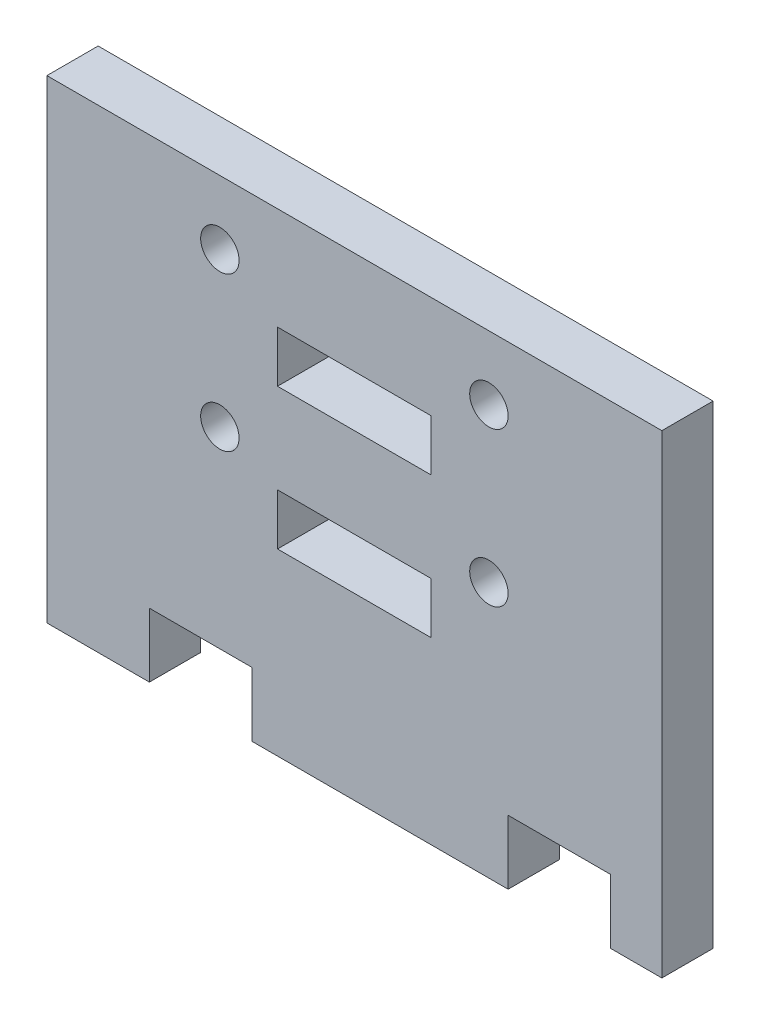
ISO-10303-21;
HEADER;
FILE_DESCRIPTION(('STEP AP214'),'2;1');
FILE_NAME('part.step','',(''),(''),'','','');
FILE_SCHEMA(('AUTOMOTIVE_DESIGN { 1 0 10303 214 1 1 1 1 }'));
ENDSEC;
DATA;
#1=APPLICATION_CONTEXT('core data for automotive mechanical design processes');
#2=APPLICATION_PROTOCOL_DEFINITION('international standard','automotive_design',2000,#1);
#3=PRODUCT_CONTEXT('',#1,'mechanical');
#4=PRODUCT('Part','Part','',(#3));
#5=PRODUCT_RELATED_PRODUCT_CATEGORY('part','',(#4));
#6=PRODUCT_DEFINITION_FORMATION('','',#4);
#7=PRODUCT_DEFINITION_CONTEXT('part definition',#1,'design');
#8=PRODUCT_DEFINITION('design','',#6,#7);
#9=PRODUCT_DEFINITION_SHAPE('','',#8);
#10=(LENGTH_UNIT() NAMED_UNIT(*) SI_UNIT(.MILLI.,.METRE.));
#11=(NAMED_UNIT(*) PLANE_ANGLE_UNIT() SI_UNIT($,.RADIAN.));
#12=(NAMED_UNIT(*) SI_UNIT($,.STERADIAN.) SOLID_ANGLE_UNIT());
#13=UNCERTAINTY_MEASURE_WITH_UNIT(LENGTH_MEASURE(1.E-05),#10,'distance_accuracy_value','');
#14=(GEOMETRIC_REPRESENTATION_CONTEXT(3) GLOBAL_UNCERTAINTY_ASSIGNED_CONTEXT((#13)) GLOBAL_UNIT_ASSIGNED_CONTEXT((#10,
#11,#12)) REPRESENTATION_CONTEXT('',''));
#15=CARTESIAN_POINT('',(0.,0.,0.));
#16=DIRECTION('',(0.,0.,1.));
#17=DIRECTION('',(1.,0.,0.));
#18=AXIS2_PLACEMENT_3D('',#15,#16,#17);
#19=CARTESIAN_POINT('',(0.,0.,2.));
#20=DIRECTION('',(0.,0.,-1.));
#21=DIRECTION('',(-1.,0.,0.));
#22=AXIS2_PLACEMENT_3D('',#19,#20,#21);
#23=PLANE('',#22);
#24=CARTESIAN_POINT('',(17.25,16.,2.));
#25=DIRECTION('',(0.,0.,1.));
#26=DIRECTION('',(-1.,0.,0.));
#27=AXIS2_PLACEMENT_3D('',#24,#25,#26);
#28=CIRCLE('',#27,0.750000000000005);
#29=CARTESIAN_POINT('',(16.5,16.,2.));
#30=VERTEX_POINT('',#29);
#31=EDGE_CURVE('E627',#30,#30,#28,.T.);
#32=ORIENTED_EDGE('',*,*,#31,.F.);
#33=EDGE_LOOP('',(#32));
#34=FACE_BOUND('',#33,.T.);
#35=DIRECTION('',(0.,-1.,0.));
#36=VECTOR('',#35,1.);
#37=CARTESIAN_POINT('',(9.00000000000001,9.,2.));
#38=LINE('',#37,#36);
#39=CARTESIAN_POINT('',(9.00000000000001,9.,2.));
#40=VERTEX_POINT('',#39);
#41=CARTESIAN_POINT('',(9.00000000000001,7.,2.));
#42=VERTEX_POINT('',#41);
#43=EDGE_CURVE('E170',#40,#42,#38,.T.);
#44=ORIENTED_EDGE('',*,*,#43,.F.);
#45=DIRECTION('',(-1.,0.,0.));
#46=VECTOR('',#45,1.);
#47=CARTESIAN_POINT('',(15.,9.,2.));
#48=LINE('',#47,#46);
#49=CARTESIAN_POINT('',(15.,9.,2.));
#50=VERTEX_POINT('',#49);
#51=EDGE_CURVE('E193',#50,#40,#48,.T.);
#52=ORIENTED_EDGE('',*,*,#51,.F.);
#53=DIRECTION('',(0.,1.,0.));
#54=VECTOR('',#53,1.);
#55=CARTESIAN_POINT('',(15.,7.,2.));
#56=LINE('',#55,#54);
#57=CARTESIAN_POINT('',(15.,7.,2.));
#58=VERTEX_POINT('',#57);
#59=EDGE_CURVE('E191',#58,#50,#56,.T.);
#60=ORIENTED_EDGE('',*,*,#59,.F.);
#61=DIRECTION('',(1.,0.,0.));
#62=VECTOR('',#61,1.);
#63=CARTESIAN_POINT('',(9.00000000000001,7.,2.));
#64=LINE('',#63,#62);
#65=EDGE_CURVE('E178',#42,#58,#64,.T.);
#66=ORIENTED_EDGE('',*,*,#65,.F.);
#67=EDGE_LOOP('',(#44,#52,#60,#66));
#68=FACE_BOUND('',#67,.T.);
#69=DIRECTION('',(1.,0.,0.));
#70=VECTOR('',#69,1.);
#71=CARTESIAN_POINT('',(9.00000000000001,12.5,2.));
#72=LINE('',#71,#70);
#73=CARTESIAN_POINT('',(9.00000000000001,12.5,2.));
#74=VERTEX_POINT('',#73);
#75=CARTESIAN_POINT('',(15.,12.5,2.));
#76=VERTEX_POINT('',#75);
#77=EDGE_CURVE('E215',#74,#76,#72,.T.);
#78=ORIENTED_EDGE('',*,*,#77,.F.);
#79=DIRECTION('',(0.,-1.,0.));
#80=VECTOR('',#79,1.);
#81=CARTESIAN_POINT('',(9.00000000000001,14.5,2.));
#82=LINE('',#81,#80);
#83=CARTESIAN_POINT('',(9.00000000000001,14.5,2.));
#84=VERTEX_POINT('',#83);
#85=EDGE_CURVE('E223',#84,#74,#82,.T.);
#86=ORIENTED_EDGE('',*,*,#85,.F.);
#87=DIRECTION('',(-1.,0.,0.));
#88=VECTOR('',#87,1.);
#89=CARTESIAN_POINT('',(15.,14.5,2.));
#90=LINE('',#89,#88);
#91=CARTESIAN_POINT('',(15.,14.5,2.));
#92=VERTEX_POINT('',#91);
#93=EDGE_CURVE('E220',#92,#84,#90,.T.);
#94=ORIENTED_EDGE('',*,*,#93,.F.);
#95=DIRECTION('',(0.,1.,0.));
#96=VECTOR('',#95,1.);
#97=CARTESIAN_POINT('',(15.,12.5,2.));
#98=LINE('',#97,#96);
#99=EDGE_CURVE('E217',#76,#92,#98,.T.);
#100=ORIENTED_EDGE('',*,*,#99,.F.);
#101=EDGE_LOOP('',(#78,#86,#94,#100));
#102=FACE_BOUND('',#101,.T.);
#103=DIRECTION('',(0.,-1.,0.));
#104=VECTOR('',#103,1.);
#105=CARTESIAN_POINT('',(0.,0.,2.));
#106=LINE('',#105,#104);
#107=CARTESIAN_POINT('',(0.,18.5,2.));
#108=VERTEX_POINT('',#107);
#109=CARTESIAN_POINT('',(0.,0.,2.));
#110=VERTEX_POINT('',#109);
#111=EDGE_CURVE('E246',#108,#110,#106,.T.);
#112=ORIENTED_EDGE('',*,*,#111,.T.);
#113=DIRECTION('',(1.,0.,0.));
#114=VECTOR('',#113,1.);
#115=CARTESIAN_POINT('',(4.,0.,2.));
#116=LINE('',#115,#114);
#117=CARTESIAN_POINT('',(4.,0.,2.));
#118=VERTEX_POINT('',#117);
#119=EDGE_CURVE('E249',#110,#118,#116,.T.);
#120=ORIENTED_EDGE('',*,*,#119,.T.);
#121=DIRECTION('',(0.,1.,0.));
#122=VECTOR('',#121,1.);
#123=CARTESIAN_POINT('',(4.,2.5,2.));
#124=LINE('',#123,#122);
#125=CARTESIAN_POINT('',(4.,2.5,2.));
#126=VERTEX_POINT('',#125);
#127=EDGE_CURVE('E252',#118,#126,#124,.T.);
#128=ORIENTED_EDGE('',*,*,#127,.T.);
#129=DIRECTION('',(1.,0.,0.));
#130=VECTOR('',#129,1.);
#131=CARTESIAN_POINT('',(4.,2.5,2.));
#132=LINE('',#131,#130);
#133=CARTESIAN_POINT('',(8.,2.5,2.));
#134=VERTEX_POINT('',#133);
#135=EDGE_CURVE('E254',#126,#134,#132,.T.);
#136=ORIENTED_EDGE('',*,*,#135,.T.);
#137=DIRECTION('',(0.,-1.,0.));
#138=VECTOR('',#137,1.);
#139=CARTESIAN_POINT('',(8.,0.,2.));
#140=LINE('',#139,#138);
#141=CARTESIAN_POINT('',(8.,0.,2.));
#142=VERTEX_POINT('',#141);
#143=EDGE_CURVE('E256',#134,#142,#140,.T.);
#144=ORIENTED_EDGE('',*,*,#143,.T.);
#145=DIRECTION('',(1.,0.,0.));
#146=VECTOR('',#145,1.);
#147=CARTESIAN_POINT('',(8.,0.,2.));
#148=LINE('',#147,#146);
#149=CARTESIAN_POINT('',(18.,0.,2.));
#150=VERTEX_POINT('',#149);
#151=EDGE_CURVE('E258',#142,#150,#148,.T.);
#152=ORIENTED_EDGE('',*,*,#151,.T.);
#153=DIRECTION('',(0.,1.,0.));
#154=VECTOR('',#153,1.);
#155=CARTESIAN_POINT('',(18.,0.,2.));
#156=LINE('',#155,#154);
#157=CARTESIAN_POINT('',(18.,2.5,2.));
#158=VERTEX_POINT('',#157);
#159=EDGE_CURVE('E260',#150,#158,#156,.T.);
#160=ORIENTED_EDGE('',*,*,#159,.T.);
#161=DIRECTION('',(1.,0.,0.));
#162=VECTOR('',#161,1.);
#163=CARTESIAN_POINT('',(18.,2.5,2.));
#164=LINE('',#163,#162);
#165=CARTESIAN_POINT('',(22.,2.5,2.));
#166=VERTEX_POINT('',#165);
#167=EDGE_CURVE('E262',#158,#166,#164,.T.);
#168=ORIENTED_EDGE('',*,*,#167,.T.);
#169=DIRECTION('',(0.,-1.,0.));
#170=VECTOR('',#169,1.);
#171=CARTESIAN_POINT('',(22.,2.5,2.));
#172=LINE('',#171,#170);
#173=CARTESIAN_POINT('',(22.,0.,2.));
#174=VERTEX_POINT('',#173);
#175=EDGE_CURVE('E264',#166,#174,#172,.T.);
#176=ORIENTED_EDGE('',*,*,#175,.T.);
#177=DIRECTION('',(1.,0.,0.));
#178=VECTOR('',#177,1.);
#179=CARTESIAN_POINT('',(22.,0.,2.));
#180=LINE('',#179,#178);
#181=CARTESIAN_POINT('',(24.,0.,2.));
#182=VERTEX_POINT('',#181);
#183=EDGE_CURVE('E266',#174,#182,#180,.T.);
#184=ORIENTED_EDGE('',*,*,#183,.T.);
#185=DIRECTION('',(0.,1.,0.));
#186=VECTOR('',#185,1.);
#187=CARTESIAN_POINT('',(24.,0.,2.));
#188=LINE('',#187,#186);
#189=CARTESIAN_POINT('',(24.,18.5,2.));
#190=VERTEX_POINT('',#189);
#191=EDGE_CURVE('E268',#182,#190,#188,.T.);
#192=ORIENTED_EDGE('',*,*,#191,.T.);
#193=DIRECTION('',(-1.,0.,0.));
#194=VECTOR('',#193,1.);
#195=CARTESIAN_POINT('',(0.,18.5,2.));
#196=LINE('',#195,#194);
#197=EDGE_CURVE('E270',#190,#108,#196,.T.);
#198=ORIENTED_EDGE('',*,*,#197,.T.);
#199=EDGE_LOOP('',(#112,#120,#128,#136,#144,#152,#160,#168,#176,#184,#192,#198));
#200=FACE_BOUND('',#199,.T.);
#201=CARTESIAN_POINT('',(6.75000000000001,16.,2.));
#202=DIRECTION('',(0.,0.,1.));
#203=DIRECTION('',(1.,0.,0.));
#204=AXIS2_PLACEMENT_3D('',#201,#202,#203);
#205=CIRCLE('',#204,0.750000000000003);
#206=CARTESIAN_POINT('',(7.50000000000001,16.,2.));
#207=VERTEX_POINT('',#206);
#208=EDGE_CURVE('E209',#207,#207,#205,.T.);
#209=ORIENTED_EDGE('',*,*,#208,.F.);
#210=EDGE_LOOP('',(#209));
#211=FACE_BOUND('',#210,.T.);
#212=CARTESIAN_POINT('',(6.75000000000001,10.,2.));
#213=DIRECTION('',(0.,0.,1.));
#214=DIRECTION('',(1.,0.,0.));
#215=AXIS2_PLACEMENT_3D('',#212,#213,#214);
#216=CIRCLE('',#215,0.750000000000003);
#217=CARTESIAN_POINT('',(7.50000000000001,10.,2.));
#218=VERTEX_POINT('',#217);
#219=EDGE_CURVE('E199',#218,#218,#216,.T.);
#220=ORIENTED_EDGE('',*,*,#219,.F.);
#221=EDGE_LOOP('',(#220));
#222=FACE_BOUND('',#221,.T.);
#223=CARTESIAN_POINT('',(17.25,9.99999999999999,2.));
#224=DIRECTION('',(0.,0.,1.));
#225=DIRECTION('',(-1.,0.,0.));
#226=AXIS2_PLACEMENT_3D('',#223,#224,#225);
#227=CIRCLE('',#226,0.750000000000005);
#228=CARTESIAN_POINT('',(16.5,9.99999999999999,2.));
#229=VERTEX_POINT('',#228);
#230=EDGE_CURVE('E618',#229,#229,#227,.T.);
#231=ORIENTED_EDGE('',*,*,#230,.F.);
#232=EDGE_LOOP('',(#231));
#233=FACE_BOUND('',#232,.T.);
#234=ADVANCED_FACE('F33',(#34,#68,#102,#200,#211,#222,#233),#23,.F.);
#235=CARTESIAN_POINT('',(0.,0.,0.));
#236=DIRECTION('',(0.,0.,-1.));
#237=DIRECTION('',(-1.,0.,0.));
#238=AXIS2_PLACEMENT_3D('',#235,#236,#237);
#239=PLANE('',#238);
#240=CARTESIAN_POINT('',(17.25,16.,0.));
#241=DIRECTION('',(0.,0.,1.));
#242=DIRECTION('',(-1.,0.,0.));
#243=AXIS2_PLACEMENT_3D('',#240,#241,#242);
#244=CIRCLE('',#243,0.750000000000005);
#245=CARTESIAN_POINT('',(16.5,16.,0.));
#246=VERTEX_POINT('',#245);
#247=EDGE_CURVE('E624',#246,#246,#244,.T.);
#248=ORIENTED_EDGE('',*,*,#247,.T.);
#249=EDGE_LOOP('',(#248));
#250=FACE_BOUND('',#249,.T.);
#251=DIRECTION('',(-1.,0.,0.));
#252=VECTOR('',#251,1.);
#253=CARTESIAN_POINT('',(15.,9.,0.));
#254=LINE('',#253,#252);
#255=CARTESIAN_POINT('',(15.,9.,0.));
#256=VERTEX_POINT('',#255);
#257=CARTESIAN_POINT('',(9.00000000000001,9.,0.));
#258=VERTEX_POINT('',#257);
#259=EDGE_CURVE('E179',#256,#258,#254,.T.);
#260=ORIENTED_EDGE('',*,*,#259,.T.);
#261=DIRECTION('',(0.,-1.,0.));
#262=VECTOR('',#261,1.);
#263=CARTESIAN_POINT('',(9.00000000000001,9.,0.));
#264=LINE('',#263,#262);
#265=CARTESIAN_POINT('',(9.00000000000001,7.,0.));
#266=VERTEX_POINT('',#265);
#267=EDGE_CURVE('E56',#258,#266,#264,.T.);
#268=ORIENTED_EDGE('',*,*,#267,.T.);
#269=DIRECTION('',(1.,0.,0.));
#270=VECTOR('',#269,1.);
#271=CARTESIAN_POINT('',(9.00000000000001,7.,0.));
#272=LINE('',#271,#270);
#273=CARTESIAN_POINT('',(15.,7.,0.));
#274=VERTEX_POINT('',#273);
#275=EDGE_CURVE('E185',#266,#274,#272,.T.);
#276=ORIENTED_EDGE('',*,*,#275,.T.);
#277=DIRECTION('',(0.,1.,0.));
#278=VECTOR('',#277,1.);
#279=CARTESIAN_POINT('',(15.,7.,0.));
#280=LINE('',#279,#278);
#281=EDGE_CURVE('E201',#274,#256,#280,.T.);
#282=ORIENTED_EDGE('',*,*,#281,.T.);
#283=EDGE_LOOP('',(#260,#268,#276,#282));
#284=FACE_BOUND('',#283,.T.);
#285=DIRECTION('',(0.,-1.,0.));
#286=VECTOR('',#285,1.);
#287=CARTESIAN_POINT('',(9.00000000000001,14.5,0.));
#288=LINE('',#287,#286);
#289=CARTESIAN_POINT('',(9.00000000000001,14.5,0.));
#290=VERTEX_POINT('',#289);
#291=CARTESIAN_POINT('',(9.00000000000001,12.5,0.));
#292=VERTEX_POINT('',#291);
#293=EDGE_CURVE('E218',#290,#292,#288,.T.);
#294=ORIENTED_EDGE('',*,*,#293,.T.);
#295=DIRECTION('',(1.,0.,0.));
#296=VECTOR('',#295,1.);
#297=CARTESIAN_POINT('',(9.00000000000001,12.5,0.));
#298=LINE('',#297,#296);
#299=CARTESIAN_POINT('',(15.,12.5,0.));
#300=VERTEX_POINT('',#299);
#301=EDGE_CURVE('E212',#292,#300,#298,.T.);
#302=ORIENTED_EDGE('',*,*,#301,.T.);
#303=DIRECTION('',(0.,1.,0.));
#304=VECTOR('',#303,1.);
#305=CARTESIAN_POINT('',(15.,12.5,0.));
#306=LINE('',#305,#304);
#307=CARTESIAN_POINT('',(15.,14.5,0.));
#308=VERTEX_POINT('',#307);
#309=EDGE_CURVE('E228',#300,#308,#306,.T.);
#310=ORIENTED_EDGE('',*,*,#309,.T.);
#311=DIRECTION('',(-1.,0.,0.));
#312=VECTOR('',#311,1.);
#313=CARTESIAN_POINT('',(15.,14.5,0.));
#314=LINE('',#313,#312);
#315=EDGE_CURVE('E231',#308,#290,#314,.T.);
#316=ORIENTED_EDGE('',*,*,#315,.T.);
#317=EDGE_LOOP('',(#294,#302,#310,#316));
#318=FACE_BOUND('',#317,.T.);
#319=DIRECTION('',(0.,-1.,0.));
#320=VECTOR('',#319,1.);
#321=CARTESIAN_POINT('',(0.,0.,0.));
#322=LINE('',#321,#320);
#323=CARTESIAN_POINT('',(0.,18.5,0.));
#324=VERTEX_POINT('',#323);
#325=CARTESIAN_POINT('',(0.,0.,0.));
#326=VERTEX_POINT('',#325);
#327=EDGE_CURVE('E245',#324,#326,#322,.T.);
#328=ORIENTED_EDGE('',*,*,#327,.F.);
#329=DIRECTION('',(-1.,0.,0.));
#330=VECTOR('',#329,1.);
#331=CARTESIAN_POINT('',(0.,18.5,0.));
#332=LINE('',#331,#330);
#333=CARTESIAN_POINT('',(24.,18.5,0.));
#334=VERTEX_POINT('',#333);
#335=EDGE_CURVE('E250',#334,#324,#332,.T.);
#336=ORIENTED_EDGE('',*,*,#335,.F.);
#337=DIRECTION('',(0.,1.,0.));
#338=VECTOR('',#337,1.);
#339=CARTESIAN_POINT('',(24.,0.,0.));
#340=LINE('',#339,#338);
#341=CARTESIAN_POINT('',(24.,0.,0.));
#342=VERTEX_POINT('',#341);
#343=EDGE_CURVE('E293',#342,#334,#340,.T.);
#344=ORIENTED_EDGE('',*,*,#343,.F.);
#345=DIRECTION('',(1.,0.,0.));
#346=VECTOR('',#345,1.);
#347=CARTESIAN_POINT('',(22.,0.,0.));
#348=LINE('',#347,#346);
#349=CARTESIAN_POINT('',(22.,0.,0.));
#350=VERTEX_POINT('',#349);
#351=EDGE_CURVE('E291',#350,#342,#348,.T.);
#352=ORIENTED_EDGE('',*,*,#351,.F.);
#353=DIRECTION('',(0.,-1.,0.));
#354=VECTOR('',#353,1.);
#355=CARTESIAN_POINT('',(22.,2.5,0.));
#356=LINE('',#355,#354);
#357=CARTESIAN_POINT('',(22.,2.5,0.));
#358=VERTEX_POINT('',#357);
#359=EDGE_CURVE('E289',#358,#350,#356,.T.);
#360=ORIENTED_EDGE('',*,*,#359,.F.);
#361=DIRECTION('',(1.,0.,0.));
#362=VECTOR('',#361,1.);
#363=CARTESIAN_POINT('',(18.,2.5,0.));
#364=LINE('',#363,#362);
#365=CARTESIAN_POINT('',(18.,2.5,0.));
#366=VERTEX_POINT('',#365);
#367=EDGE_CURVE('E287',#366,#358,#364,.T.);
#368=ORIENTED_EDGE('',*,*,#367,.F.);
#369=DIRECTION('',(0.,1.,0.));
#370=VECTOR('',#369,1.);
#371=CARTESIAN_POINT('',(18.,0.,0.));
#372=LINE('',#371,#370);
#373=CARTESIAN_POINT('',(18.,0.,0.));
#374=VERTEX_POINT('',#373);
#375=EDGE_CURVE('E285',#374,#366,#372,.T.);
#376=ORIENTED_EDGE('',*,*,#375,.F.);
#377=DIRECTION('',(1.,0.,0.));
#378=VECTOR('',#377,1.);
#379=CARTESIAN_POINT('',(8.,0.,0.));
#380=LINE('',#379,#378);
#381=CARTESIAN_POINT('',(8.,0.,0.));
#382=VERTEX_POINT('',#381);
#383=EDGE_CURVE('E283',#382,#374,#380,.T.);
#384=ORIENTED_EDGE('',*,*,#383,.F.);
#385=DIRECTION('',(0.,-1.,0.));
#386=VECTOR('',#385,1.);
#387=CARTESIAN_POINT('',(8.,0.,0.));
#388=LINE('',#387,#386);
#389=CARTESIAN_POINT('',(8.,2.5,0.));
#390=VERTEX_POINT('',#389);
#391=EDGE_CURVE('E281',#390,#382,#388,.T.);
#392=ORIENTED_EDGE('',*,*,#391,.F.);
#393=DIRECTION('',(1.,0.,0.));
#394=VECTOR('',#393,1.);
#395=CARTESIAN_POINT('',(4.,2.5,0.));
#396=LINE('',#395,#394);
#397=CARTESIAN_POINT('',(4.,2.5,0.));
#398=VERTEX_POINT('',#397);
#399=EDGE_CURVE('E279',#398,#390,#396,.T.);
#400=ORIENTED_EDGE('',*,*,#399,.F.);
#401=DIRECTION('',(0.,1.,0.));
#402=VECTOR('',#401,1.);
#403=CARTESIAN_POINT('',(4.,2.5,0.));
#404=LINE('',#403,#402);
#405=CARTESIAN_POINT('',(4.,0.,0.));
#406=VERTEX_POINT('',#405);
#407=EDGE_CURVE('E277',#406,#398,#404,.T.);
#408=ORIENTED_EDGE('',*,*,#407,.F.);
#409=DIRECTION('',(1.,0.,0.));
#410=VECTOR('',#409,1.);
#411=CARTESIAN_POINT('',(4.,0.,0.));
#412=LINE('',#411,#410);
#413=EDGE_CURVE('E275',#326,#406,#412,.T.);
#414=ORIENTED_EDGE('',*,*,#413,.F.);
#415=EDGE_LOOP('',(#328,#336,#344,#352,#360,#368,#376,#384,#392,#400,#408,#414));
#416=FACE_BOUND('',#415,.T.);
#417=CARTESIAN_POINT('',(6.75000000000001,16.,0.));
#418=DIRECTION('',(0.,0.,1.));
#419=DIRECTION('',(1.,0.,0.));
#420=AXIS2_PLACEMENT_3D('',#417,#418,#419);
#421=CIRCLE('',#420,0.750000000000003);
#422=CARTESIAN_POINT('',(7.50000000000001,16.,0.));
#423=VERTEX_POINT('',#422);
#424=EDGE_CURVE('E186',#423,#423,#421,.T.);
#425=ORIENTED_EDGE('',*,*,#424,.T.);
#426=EDGE_LOOP('',(#425));
#427=FACE_BOUND('',#426,.T.);
#428=CARTESIAN_POINT('',(6.75000000000001,10.,0.));
#429=DIRECTION('',(0.,0.,1.));
#430=DIRECTION('',(1.,0.,0.));
#431=AXIS2_PLACEMENT_3D('',#428,#429,#430);
#432=CIRCLE('',#431,0.750000000000003);
#433=CARTESIAN_POINT('',(7.50000000000001,10.,0.));
#434=VERTEX_POINT('',#433);
#435=EDGE_CURVE('E630',#434,#434,#432,.T.);
#436=ORIENTED_EDGE('',*,*,#435,.T.);
#437=EDGE_LOOP('',(#436));
#438=FACE_BOUND('',#437,.T.);
#439=CARTESIAN_POINT('',(17.25,9.99999999999999,0.));
#440=DIRECTION('',(0.,0.,1.));
#441=DIRECTION('',(-1.,0.,0.));
#442=AXIS2_PLACEMENT_3D('',#439,#440,#441);
#443=CIRCLE('',#442,0.750000000000005);
#444=CARTESIAN_POINT('',(16.5,9.99999999999999,0.));
#445=VERTEX_POINT('',#444);
#446=EDGE_CURVE('E621',#445,#445,#443,.T.);
#447=ORIENTED_EDGE('',*,*,#446,.T.);
#448=EDGE_LOOP('',(#447));
#449=FACE_BOUND('',#448,.T.);
#450=ADVANCED_FACE('F335',(#250,#284,#318,#416,#427,#438,#449),#239,.T.);
#451=CARTESIAN_POINT('',(0.,0.,2.));
#452=DIRECTION('',(1.,0.,0.));
#453=DIRECTION('',(0.,0.,-1.));
#454=AXIS2_PLACEMENT_3D('',#451,#452,#453);
#455=PLANE('',#454);
#456=ORIENTED_EDGE('',*,*,#327,.T.);
#457=DIRECTION('',(0.,0.,-1.));
#458=VECTOR('',#457,1.);
#459=CARTESIAN_POINT('',(0.,0.,2.));
#460=LINE('',#459,#458);
#461=EDGE_CURVE('E11',#110,#326,#460,.T.);
#462=ORIENTED_EDGE('',*,*,#461,.F.);
#463=ORIENTED_EDGE('',*,*,#111,.F.);
#464=DIRECTION('',(0.,0.,-1.));
#465=VECTOR('',#464,1.);
#466=CARTESIAN_POINT('',(0.,18.5,2.));
#467=LINE('',#466,#465);
#468=EDGE_CURVE('E272',#108,#324,#467,.T.);
#469=ORIENTED_EDGE('',*,*,#468,.T.);
#470=EDGE_LOOP('',(#456,#462,#463,#469));
#471=FACE_BOUND('',#470,.T.);
#472=ADVANCED_FACE('F35',(#471),#455,.F.);
#473=CARTESIAN_POINT('',(4.,0.,2.));
#474=DIRECTION('',(0.,1.,0.));
#475=DIRECTION('',(-1.,0.,0.));
#476=AXIS2_PLACEMENT_3D('',#473,#474,#475);
#477=PLANE('',#476);
#478=ORIENTED_EDGE('',*,*,#413,.T.);
#479=DIRECTION('',(0.,0.,-1.));
#480=VECTOR('',#479,1.);
#481=CARTESIAN_POINT('',(4.,0.,2.));
#482=LINE('',#481,#480);
#483=EDGE_CURVE('E41',#118,#406,#482,.T.);
#484=ORIENTED_EDGE('',*,*,#483,.F.);
#485=ORIENTED_EDGE('',*,*,#119,.F.);
#486=ORIENTED_EDGE('',*,*,#461,.T.);
#487=EDGE_LOOP('',(#478,#484,#485,#486));
#488=FACE_BOUND('',#487,.T.);
#489=ADVANCED_FACE('F353',(#488),#477,.F.);
#490=CARTESIAN_POINT('',(4.,2.5,2.));
#491=DIRECTION('',(-1.,0.,0.));
#492=DIRECTION('',(0.,-1.,0.));
#493=AXIS2_PLACEMENT_3D('',#490,#491,#492);
#494=PLANE('',#493);
#495=ORIENTED_EDGE('',*,*,#407,.T.);
#496=DIRECTION('',(0.,0.,-1.));
#497=VECTOR('',#496,1.);
#498=CARTESIAN_POINT('',(4.,2.5,2.));
#499=LINE('',#498,#497);
#500=EDGE_CURVE('E322',#126,#398,#499,.T.);
#501=ORIENTED_EDGE('',*,*,#500,.F.);
#502=ORIENTED_EDGE('',*,*,#127,.F.);
#503=ORIENTED_EDGE('',*,*,#483,.T.);
#504=EDGE_LOOP('',(#495,#501,#502,#503));
#505=FACE_BOUND('',#504,.T.);
#506=ADVANCED_FACE('F329',(#505),#494,.F.);
#507=CARTESIAN_POINT('',(4.,2.5,2.));
#508=DIRECTION('',(0.,1.,0.));
#509=DIRECTION('',(-1.,0.,0.));
#510=AXIS2_PLACEMENT_3D('',#507,#508,#509);
#511=PLANE('',#510);
#512=ORIENTED_EDGE('',*,*,#399,.T.);
#513=DIRECTION('',(0.,0.,-1.));
#514=VECTOR('',#513,1.);
#515=CARTESIAN_POINT('',(8.,2.5,2.));
#516=LINE('',#515,#514);
#517=EDGE_CURVE('E319',#134,#390,#516,.T.);
#518=ORIENTED_EDGE('',*,*,#517,.F.);
#519=ORIENTED_EDGE('',*,*,#135,.F.);
#520=ORIENTED_EDGE('',*,*,#500,.T.);
#521=EDGE_LOOP('',(#512,#518,#519,#520));
#522=FACE_BOUND('',#521,.T.);
#523=ADVANCED_FACE('F341',(#522),#511,.F.);
#524=CARTESIAN_POINT('',(8.,0.,2.));
#525=DIRECTION('',(1.,0.,0.));
#526=DIRECTION('',(0.,0.,-1.));
#527=AXIS2_PLACEMENT_3D('',#524,#525,#526);
#528=PLANE('',#527);
#529=ORIENTED_EDGE('',*,*,#391,.T.);
#530=DIRECTION('',(0.,0.,-1.));
#531=VECTOR('',#530,1.);
#532=CARTESIAN_POINT('',(8.,0.,2.));
#533=LINE('',#532,#531);
#534=EDGE_CURVE('E316',#142,#382,#533,.T.);
#535=ORIENTED_EDGE('',*,*,#534,.F.);
#536=ORIENTED_EDGE('',*,*,#143,.F.);
#537=ORIENTED_EDGE('',*,*,#517,.T.);
#538=EDGE_LOOP('',(#529,#535,#536,#537));
#539=FACE_BOUND('',#538,.T.);
#540=ADVANCED_FACE('F345',(#539),#528,.F.);
#541=CARTESIAN_POINT('',(8.,0.,2.));
#542=DIRECTION('',(0.,1.,0.));
#543=DIRECTION('',(-1.,0.,0.));
#544=AXIS2_PLACEMENT_3D('',#541,#542,#543);
#545=PLANE('',#544);
#546=ORIENTED_EDGE('',*,*,#383,.T.);
#547=DIRECTION('',(0.,0.,-1.));
#548=VECTOR('',#547,1.);
#549=CARTESIAN_POINT('',(18.,0.,2.));
#550=LINE('',#549,#548);
#551=EDGE_CURVE('E313',#150,#374,#550,.T.);
#552=ORIENTED_EDGE('',*,*,#551,.F.);
#553=ORIENTED_EDGE('',*,*,#151,.F.);
#554=ORIENTED_EDGE('',*,*,#534,.T.);
#555=EDGE_LOOP('',(#546,#552,#553,#554));
#556=FACE_BOUND('',#555,.T.);
#557=ADVANCED_FACE('F386',(#556),#545,.F.);
#558=CARTESIAN_POINT('',(18.,0.,2.));
#559=DIRECTION('',(-1.,0.,0.));
#560=DIRECTION('',(0.,0.,1.));
#561=AXIS2_PLACEMENT_3D('',#558,#559,#560);
#562=PLANE('',#561);
#563=ORIENTED_EDGE('',*,*,#375,.T.);
#564=DIRECTION('',(0.,0.,-1.));
#565=VECTOR('',#564,1.);
#566=CARTESIAN_POINT('',(18.,2.5,2.));
#567=LINE('',#566,#565);
#568=EDGE_CURVE('E310',#158,#366,#567,.T.);
#569=ORIENTED_EDGE('',*,*,#568,.F.);
#570=ORIENTED_EDGE('',*,*,#159,.F.);
#571=ORIENTED_EDGE('',*,*,#551,.T.);
#572=EDGE_LOOP('',(#563,#569,#570,#571));
#573=FACE_BOUND('',#572,.T.);
#574=ADVANCED_FACE('F384',(#573),#562,.F.);
#575=CARTESIAN_POINT('',(18.,2.5,2.));
#576=DIRECTION('',(0.,1.,0.));
#577=DIRECTION('',(-1.,0.,0.));
#578=AXIS2_PLACEMENT_3D('',#575,#576,#577);
#579=PLANE('',#578);
#580=ORIENTED_EDGE('',*,*,#367,.T.);
#581=DIRECTION('',(0.,0.,-1.));
#582=VECTOR('',#581,1.);
#583=CARTESIAN_POINT('',(22.,2.5,2.));
#584=LINE('',#583,#582);
#585=EDGE_CURVE('E307',#166,#358,#584,.T.);
#586=ORIENTED_EDGE('',*,*,#585,.F.);
#587=ORIENTED_EDGE('',*,*,#167,.F.);
#588=ORIENTED_EDGE('',*,*,#568,.T.);
#589=EDGE_LOOP('',(#580,#586,#587,#588));
#590=FACE_BOUND('',#589,.T.);
#591=ADVANCED_FACE('F380',(#590),#579,.F.);
#592=CARTESIAN_POINT('',(22.,2.5,2.));
#593=DIRECTION('',(1.,0.,0.));
#594=DIRECTION('',(0.,1.,0.));
#595=AXIS2_PLACEMENT_3D('',#592,#593,#594);
#596=PLANE('',#595);
#597=ORIENTED_EDGE('',*,*,#359,.T.);
#598=DIRECTION('',(0.,0.,-1.));
#599=VECTOR('',#598,1.);
#600=CARTESIAN_POINT('',(22.,0.,2.));
#601=LINE('',#600,#599);
#602=EDGE_CURVE('E304',#174,#350,#601,.T.);
#603=ORIENTED_EDGE('',*,*,#602,.F.);
#604=ORIENTED_EDGE('',*,*,#175,.F.);
#605=ORIENTED_EDGE('',*,*,#585,.T.);
#606=EDGE_LOOP('',(#597,#603,#604,#605));
#607=FACE_BOUND('',#606,.T.);
#608=ADVANCED_FACE('F375',(#607),#596,.F.);
#609=CARTESIAN_POINT('',(22.,0.,2.));
#610=DIRECTION('',(0.,1.,0.));
#611=DIRECTION('',(0.,0.,1.));
#612=AXIS2_PLACEMENT_3D('',#609,#610,#611);
#613=PLANE('',#612);
#614=ORIENTED_EDGE('',*,*,#351,.T.);
#615=DIRECTION('',(0.,0.,-1.));
#616=VECTOR('',#615,1.);
#617=CARTESIAN_POINT('',(24.,0.,2.));
#618=LINE('',#617,#616);
#619=EDGE_CURVE('E301',#182,#342,#618,.T.);
#620=ORIENTED_EDGE('',*,*,#619,.F.);
#621=ORIENTED_EDGE('',*,*,#183,.F.);
#622=ORIENTED_EDGE('',*,*,#602,.T.);
#623=EDGE_LOOP('',(#614,#620,#621,#622));
#624=FACE_BOUND('',#623,.T.);
#625=ADVANCED_FACE('F369',(#624),#613,.F.);
#626=CARTESIAN_POINT('',(24.,0.,2.));
#627=DIRECTION('',(-1.,0.,0.));
#628=DIRECTION('',(0.,0.,1.));
#629=AXIS2_PLACEMENT_3D('',#626,#627,#628);
#630=PLANE('',#629);
#631=ORIENTED_EDGE('',*,*,#343,.T.);
#632=DIRECTION('',(0.,0.,-1.));
#633=VECTOR('',#632,1.);
#634=CARTESIAN_POINT('',(24.,18.5,2.));
#635=LINE('',#634,#633);
#636=EDGE_CURVE('E298',#190,#334,#635,.T.);
#637=ORIENTED_EDGE('',*,*,#636,.F.);
#638=ORIENTED_EDGE('',*,*,#191,.F.);
#639=ORIENTED_EDGE('',*,*,#619,.T.);
#640=EDGE_LOOP('',(#631,#637,#638,#639));
#641=FACE_BOUND('',#640,.T.);
#642=ADVANCED_FACE('F365',(#641),#630,.F.);
#643=CARTESIAN_POINT('',(0.,18.5,2.));
#644=DIRECTION('',(0.,-1.,0.));
#645=DIRECTION('',(0.,0.,-1.));
#646=AXIS2_PLACEMENT_3D('',#643,#644,#645);
#647=PLANE('',#646);
#648=ORIENTED_EDGE('',*,*,#335,.T.);
#649=ORIENTED_EDGE('',*,*,#468,.F.);
#650=ORIENTED_EDGE('',*,*,#197,.F.);
#651=ORIENTED_EDGE('',*,*,#636,.T.);
#652=EDGE_LOOP('',(#648,#649,#650,#651));
#653=FACE_BOUND('',#652,.T.);
#654=ADVANCED_FACE('F360',(#653),#647,.F.);
#655=CARTESIAN_POINT('',(9.00000000000001,12.5,2.));
#656=DIRECTION('',(0.,1.,0.));
#657=DIRECTION('',(-1.,0.,0.));
#658=AXIS2_PLACEMENT_3D('',#655,#656,#657);
#659=PLANE('',#658);
#660=ORIENTED_EDGE('',*,*,#301,.F.);
#661=DIRECTION('',(0.,0.,-1.));
#662=VECTOR('',#661,1.);
#663=CARTESIAN_POINT('',(9.00000000000001,12.5,2.));
#664=LINE('',#663,#662);
#665=EDGE_CURVE('E225',#74,#292,#664,.T.);
#666=ORIENTED_EDGE('',*,*,#665,.F.);
#667=ORIENTED_EDGE('',*,*,#77,.T.);
#668=DIRECTION('',(0.,0.,-1.));
#669=VECTOR('',#668,1.);
#670=CARTESIAN_POINT('',(15.,12.5,2.));
#671=LINE('',#670,#669);
#672=EDGE_CURVE('E242',#76,#300,#671,.T.);
#673=ORIENTED_EDGE('',*,*,#672,.T.);
#674=EDGE_LOOP('',(#660,#666,#667,#673));
#675=FACE_BOUND('',#674,.T.);
#676=ADVANCED_FACE('F405',(#675),#659,.T.);
#677=CARTESIAN_POINT('',(15.,12.5,2.));
#678=DIRECTION('',(-1.,0.,0.));
#679=DIRECTION('',(0.,0.,1.));
#680=AXIS2_PLACEMENT_3D('',#677,#678,#679);
#681=PLANE('',#680);
#682=ORIENTED_EDGE('',*,*,#309,.F.);
#683=ORIENTED_EDGE('',*,*,#672,.F.);
#684=ORIENTED_EDGE('',*,*,#99,.T.);
#685=DIRECTION('',(0.,0.,-1.));
#686=VECTOR('',#685,1.);
#687=CARTESIAN_POINT('',(15.,14.5,2.));
#688=LINE('',#687,#686);
#689=EDGE_CURVE('E240',#92,#308,#688,.T.);
#690=ORIENTED_EDGE('',*,*,#689,.T.);
#691=EDGE_LOOP('',(#682,#683,#684,#690));
#692=FACE_BOUND('',#691,.T.);
#693=ADVANCED_FACE('F443',(#692),#681,.T.);
#694=CARTESIAN_POINT('',(15.,14.5,2.));
#695=DIRECTION('',(0.,-1.,0.));
#696=DIRECTION('',(1.,0.,0.));
#697=AXIS2_PLACEMENT_3D('',#694,#695,#696);
#698=PLANE('',#697);
#699=ORIENTED_EDGE('',*,*,#315,.F.);
#700=ORIENTED_EDGE('',*,*,#689,.F.);
#701=ORIENTED_EDGE('',*,*,#93,.T.);
#702=DIRECTION('',(0.,0.,-1.));
#703=VECTOR('',#702,1.);
#704=CARTESIAN_POINT('',(9.00000000000001,14.5,2.));
#705=LINE('',#704,#703);
#706=EDGE_CURVE('E238',#84,#290,#705,.T.);
#707=ORIENTED_EDGE('',*,*,#706,.T.);
#708=EDGE_LOOP('',(#699,#700,#701,#707));
#709=FACE_BOUND('',#708,.T.);
#710=ADVANCED_FACE('F450',(#709),#698,.T.);
#711=CARTESIAN_POINT('',(9.00000000000001,14.5,2.));
#712=DIRECTION('',(1.,0.,0.));
#713=DIRECTION('',(0.,0.,-1.));
#714=AXIS2_PLACEMENT_3D('',#711,#712,#713);
#715=PLANE('',#714);
#716=ORIENTED_EDGE('',*,*,#293,.F.);
#717=ORIENTED_EDGE('',*,*,#706,.F.);
#718=ORIENTED_EDGE('',*,*,#85,.T.);
#719=ORIENTED_EDGE('',*,*,#665,.T.);
#720=EDGE_LOOP('',(#716,#717,#718,#719));
#721=FACE_BOUND('',#720,.T.);
#722=ADVANCED_FACE('F457',(#721),#715,.T.);
#723=CARTESIAN_POINT('',(6.75000000000001,16.,2.));
#724=DIRECTION('',(0.,0.,-1.));
#725=DIRECTION('',(-1.,0.,0.));
#726=AXIS2_PLACEMENT_3D('',#723,#724,#725);
#727=CYLINDRICAL_SURFACE('',#726,0.750000000000003);
#728=ORIENTED_EDGE('',*,*,#208,.T.);
#729=EDGE_LOOP('',(#728));
#730=FACE_BOUND('',#729,.T.);
#731=ORIENTED_EDGE('',*,*,#424,.F.);
#732=EDGE_LOOP('',(#731));
#733=FACE_BOUND('',#732,.T.);
#734=ADVANCED_FACE('F465',(#730,#733),#727,.F.);
#735=CARTESIAN_POINT('',(9.00000000000001,9.,2.));
#736=DIRECTION('',(1.,0.,0.));
#737=DIRECTION('',(0.,0.,-1.));
#738=AXIS2_PLACEMENT_3D('',#735,#736,#737);
#739=PLANE('',#738);
#740=ORIENTED_EDGE('',*,*,#267,.F.);
#741=DIRECTION('',(0.,0.,-1.));
#742=VECTOR('',#741,1.);
#743=CARTESIAN_POINT('',(9.00000000000001,9.,2.));
#744=LINE('',#743,#742);
#745=EDGE_CURVE('E174',#40,#258,#744,.T.);
#746=ORIENTED_EDGE('',*,*,#745,.F.);
#747=ORIENTED_EDGE('',*,*,#43,.T.);
#748=DIRECTION('',(0.,0.,-1.));
#749=VECTOR('',#748,1.);
#750=CARTESIAN_POINT('',(9.00000000000001,7.,2.));
#751=LINE('',#750,#749);
#752=EDGE_CURVE('E173',#42,#266,#751,.T.);
#753=ORIENTED_EDGE('',*,*,#752,.T.);
#754=EDGE_LOOP('',(#740,#746,#747,#753));
#755=FACE_BOUND('',#754,.T.);
#756=ADVANCED_FACE('F172',(#755),#739,.T.);
#757=CARTESIAN_POINT('',(9.00000000000001,7.,2.));
#758=DIRECTION('',(0.,1.,0.));
#759=DIRECTION('',(0.,0.,1.));
#760=AXIS2_PLACEMENT_3D('',#757,#758,#759);
#761=PLANE('',#760);
#762=ORIENTED_EDGE('',*,*,#275,.F.);
#763=ORIENTED_EDGE('',*,*,#752,.F.);
#764=ORIENTED_EDGE('',*,*,#65,.T.);
#765=DIRECTION('',(0.,0.,-1.));
#766=VECTOR('',#765,1.);
#767=CARTESIAN_POINT('',(15.,7.,2.));
#768=LINE('',#767,#766);
#769=EDGE_CURVE('E187',#58,#274,#768,.T.);
#770=ORIENTED_EDGE('',*,*,#769,.T.);
#771=EDGE_LOOP('',(#762,#763,#764,#770));
#772=FACE_BOUND('',#771,.T.);
#773=ADVANCED_FACE('F182',(#772),#761,.T.);
#774=CARTESIAN_POINT('',(15.,7.,2.));
#775=DIRECTION('',(-1.,0.,0.));
#776=DIRECTION('',(0.,0.,1.));
#777=AXIS2_PLACEMENT_3D('',#774,#775,#776);
#778=PLANE('',#777);
#779=ORIENTED_EDGE('',*,*,#281,.F.);
#780=ORIENTED_EDGE('',*,*,#769,.F.);
#781=ORIENTED_EDGE('',*,*,#59,.T.);
#782=DIRECTION('',(0.,0.,-1.));
#783=VECTOR('',#782,1.);
#784=CARTESIAN_POINT('',(15.,9.,2.));
#785=LINE('',#784,#783);
#786=EDGE_CURVE('E48',#50,#256,#785,.T.);
#787=ORIENTED_EDGE('',*,*,#786,.T.);
#788=EDGE_LOOP('',(#779,#780,#781,#787));
#789=FACE_BOUND('',#788,.T.);
#790=ADVANCED_FACE('F486',(#789),#778,.T.);
#791=CARTESIAN_POINT('',(15.,9.,2.));
#792=DIRECTION('',(0.,-1.,0.));
#793=DIRECTION('',(1.,0.,0.));
#794=AXIS2_PLACEMENT_3D('',#791,#792,#793);
#795=PLANE('',#794);
#796=ORIENTED_EDGE('',*,*,#259,.F.);
#797=ORIENTED_EDGE('',*,*,#786,.F.);
#798=ORIENTED_EDGE('',*,*,#51,.T.);
#799=ORIENTED_EDGE('',*,*,#745,.T.);
#800=EDGE_LOOP('',(#796,#797,#798,#799));
#801=FACE_BOUND('',#800,.T.);
#802=ADVANCED_FACE('F493',(#801),#795,.T.);
#803=CARTESIAN_POINT('',(6.75000000000001,10.,2.));
#804=DIRECTION('',(0.,0.,-1.));
#805=DIRECTION('',(-1.,0.,0.));
#806=AXIS2_PLACEMENT_3D('',#803,#804,#805);
#807=CYLINDRICAL_SURFACE('',#806,0.750000000000003);
#808=ORIENTED_EDGE('',*,*,#219,.T.);
#809=EDGE_LOOP('',(#808));
#810=FACE_BOUND('',#809,.T.);
#811=ORIENTED_EDGE('',*,*,#435,.F.);
#812=EDGE_LOOP('',(#811));
#813=FACE_BOUND('',#812,.T.);
#814=ADVANCED_FACE('F501',(#810,#813),#807,.F.);
#815=CARTESIAN_POINT('',(17.25,16.,2.));
#816=DIRECTION('',(0.,0.,-1.));
#817=DIRECTION('',(-1.,0.,0.));
#818=AXIS2_PLACEMENT_3D('',#815,#816,#817);
#819=CYLINDRICAL_SURFACE('',#818,0.750000000000005);
#820=ORIENTED_EDGE('',*,*,#31,.T.);
#821=EDGE_LOOP('',(#820));
#822=FACE_BOUND('',#821,.T.);
#823=ORIENTED_EDGE('',*,*,#247,.F.);
#824=EDGE_LOOP('',(#823));
#825=FACE_BOUND('',#824,.T.);
#826=ADVANCED_FACE('F508',(#822,#825),#819,.F.);
#827=CARTESIAN_POINT('',(17.25,9.99999999999999,2.));
#828=DIRECTION('',(0.,0.,-1.));
#829=DIRECTION('',(-1.,0.,0.));
#830=AXIS2_PLACEMENT_3D('',#827,#828,#829);
#831=CYLINDRICAL_SURFACE('',#830,0.750000000000005);
#832=ORIENTED_EDGE('',*,*,#230,.T.);
#833=EDGE_LOOP('',(#832));
#834=FACE_BOUND('',#833,.T.);
#835=ORIENTED_EDGE('',*,*,#446,.F.);
#836=EDGE_LOOP('',(#835));
#837=FACE_BOUND('',#836,.T.);
#838=ADVANCED_FACE('F516',(#834,#837),#831,.F.);
#839=CLOSED_SHELL('',(#234,#450,#472,#489,#506,#523,#540,#557,#574,#591,#608,#625,#642,#654,
#676,#693,#710,#722,#734,#756,#773,#790,#802,#814,#826,#838));
#840=MANIFOLD_SOLID_BREP('B2',#839);
#841=ADVANCED_BREP_SHAPE_REPRESENTATION('',(#18,#840),#14);
#842=SHAPE_DEFINITION_REPRESENTATION(#9,#841);
ENDSEC;
END-ISO-10303-21;
